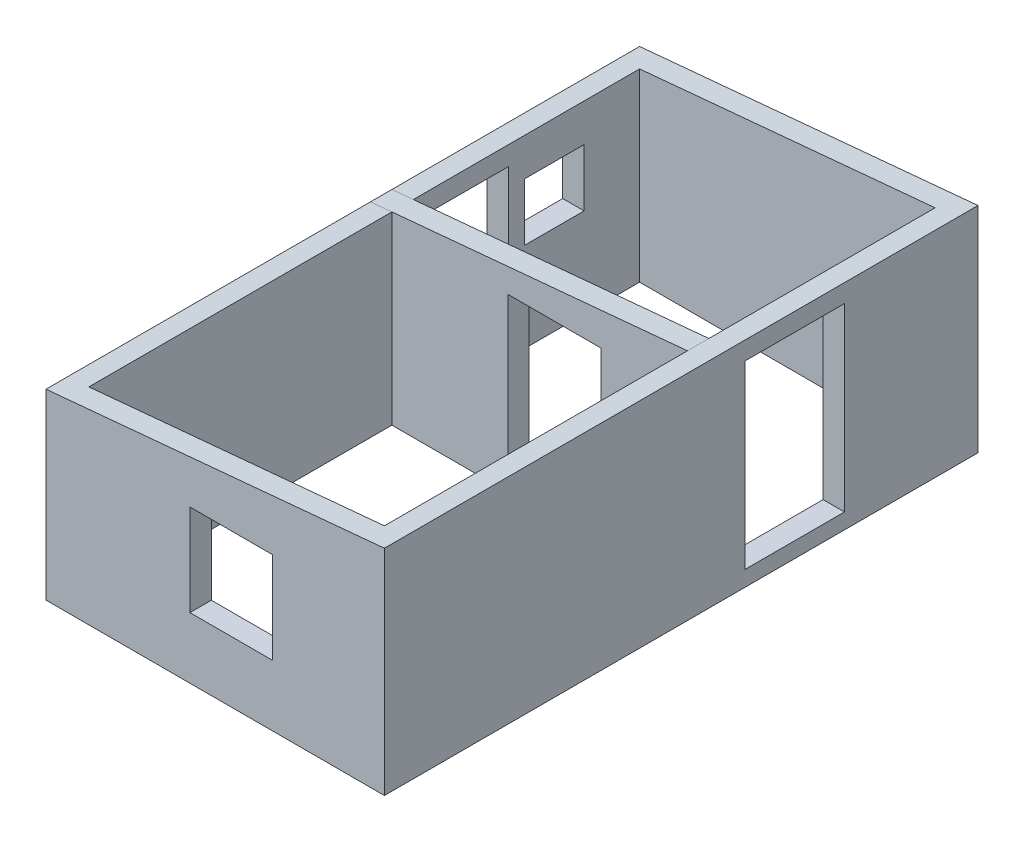
ISO-10303-21;
HEADER;
FILE_DESCRIPTION(('STEP AP214'),'2;1');
FILE_NAME('part.step','',(''),(''),'','','');
FILE_SCHEMA(('AUTOMOTIVE_DESIGN { 1 0 10303 214 1 1 1 1 }'));
ENDSEC;
DATA;
#1=APPLICATION_CONTEXT('core data for automotive mechanical design processes');
#2=APPLICATION_PROTOCOL_DEFINITION('international standard','automotive_design',2000,#1);
#3=PRODUCT_CONTEXT('',#1,'mechanical');
#4=PRODUCT('Part','Part','',(#3));
#5=PRODUCT_RELATED_PRODUCT_CATEGORY('part','',(#4));
#6=PRODUCT_DEFINITION_FORMATION('','',#4);
#7=PRODUCT_DEFINITION_CONTEXT('part definition',#1,'design');
#8=PRODUCT_DEFINITION('design','',#6,#7);
#9=PRODUCT_DEFINITION_SHAPE('','',#8);
#10=(LENGTH_UNIT() NAMED_UNIT(*) SI_UNIT(.MILLI.,.METRE.));
#11=(NAMED_UNIT(*) PLANE_ANGLE_UNIT() SI_UNIT($,.RADIAN.));
#12=(NAMED_UNIT(*) SI_UNIT($,.STERADIAN.) SOLID_ANGLE_UNIT());
#13=UNCERTAINTY_MEASURE_WITH_UNIT(LENGTH_MEASURE(1.E-05),#10,'distance_accuracy_value','');
#14=(GEOMETRIC_REPRESENTATION_CONTEXT(3) GLOBAL_UNCERTAINTY_ASSIGNED_CONTEXT((#13)) GLOBAL_UNIT_ASSIGNED_CONTEXT((#10,
#11,#12)) REPRESENTATION_CONTEXT('',''));
#15=CARTESIAN_POINT('',(0.,0.,0.));
#16=DIRECTION('',(0.,0.,1.));
#17=DIRECTION('',(1.,0.,0.));
#18=AXIS2_PLACEMENT_3D('',#15,#16,#17);
#19=CARTESIAN_POINT('',(0.,0.,0.));
#20=DIRECTION('',(0.,1.,0.));
#21=DIRECTION('',(0.,0.,1.));
#22=AXIS2_PLACEMENT_3D('',#19,#20,#21);
#23=PLANE('',#22);
#24=DIRECTION('',(0.,0.,1.));
#25=VECTOR('',#24,1.);
#26=CARTESIAN_POINT('',(0.,0.,-5543.));
#27=LINE('',#26,#25);
#28=CARTESIAN_POINT('',(0.,0.,-3313.22293132406));
#29=VERTEX_POINT('',#28);
#30=CARTESIAN_POINT('',(0.,0.,0.));
#31=VERTEX_POINT('',#30);
#32=EDGE_CURVE('E390',#29,#31,#27,.T.);
#33=ORIENTED_EDGE('',*,*,#32,.F.);
#34=DIRECTION('',(-1.,0.,0.));
#35=VECTOR('',#34,1.);
#36=CARTESIAN_POINT('',(1944.3628833001,0.,-3313.22293132406));
#37=LINE('',#36,#35);
#38=CARTESIAN_POINT('',(200.,0.,-3313.22293132406));
#39=VERTEX_POINT('',#38);
#40=EDGE_CURVE('E301',#39,#29,#37,.T.);
#41=ORIENTED_EDGE('',*,*,#40,.F.);
#42=DIRECTION('',(0.,0.,1.));
#43=VECTOR('',#42,1.);
#44=CARTESIAN_POINT('',(200.,0.,-5543.));
#45=LINE('',#44,#43);
#46=CARTESIAN_POINT('',(200.,0.,-200.));
#47=VERTEX_POINT('',#46);
#48=EDGE_CURVE('E368',#39,#47,#45,.T.);
#49=ORIENTED_EDGE('',*,*,#48,.T.);
#50=DIRECTION('',(1.,0.,0.));
#51=VECTOR('',#50,1.);
#52=CARTESIAN_POINT('',(0.,0.,-200.));
#53=LINE('',#52,#51);
#54=CARTESIAN_POINT('',(2960.,0.,-200.));
#55=VERTEX_POINT('',#54);
#56=EDGE_CURVE('E372',#47,#55,#53,.T.);
#57=ORIENTED_EDGE('',*,*,#56,.T.);
#58=DIRECTION('',(0.,0.,-1.));
#59=VECTOR('',#58,1.);
#60=CARTESIAN_POINT('',(2960.,0.,-5543.));
#61=LINE('',#60,#59);
#62=CARTESIAN_POINT('',(2960.,0.,-5343.));
#63=VERTEX_POINT('',#62);
#64=EDGE_CURVE('E375',#55,#63,#61,.T.);
#65=ORIENTED_EDGE('',*,*,#64,.T.);
#66=DIRECTION('',(-1.,0.,0.));
#67=VECTOR('',#66,1.);
#68=CARTESIAN_POINT('',(0.,0.,-5343.));
#69=LINE('',#68,#67);
#70=CARTESIAN_POINT('',(200.,0.,-5343.));
#71=VERTEX_POINT('',#70);
#72=EDGE_CURVE('E378',#63,#71,#69,.T.);
#73=ORIENTED_EDGE('',*,*,#72,.T.);
#74=CARTESIAN_POINT('',(200.,0.,-4118.48675987534));
#75=VERTEX_POINT('',#74);
#76=EDGE_CURVE('E369',#71,#75,#45,.T.);
#77=ORIENTED_EDGE('',*,*,#76,.T.);
#78=DIRECTION('',(-1.,0.,0.));
#79=VECTOR('',#78,1.);
#80=CARTESIAN_POINT('',(1944.3628833001,0.,-4118.48675987534));
#81=LINE('',#80,#79);
#82=CARTESIAN_POINT('',(0.,0.,-4118.48675987534));
#83=VERTEX_POINT('',#82);
#84=EDGE_CURVE('E309',#75,#83,#81,.T.);
#85=ORIENTED_EDGE('',*,*,#84,.T.);
#86=CARTESIAN_POINT('',(0.,0.,-5543.));
#87=VERTEX_POINT('',#86);
#88=EDGE_CURVE('E395',#87,#83,#27,.T.);
#89=ORIENTED_EDGE('',*,*,#88,.F.);
#90=DIRECTION('',(-1.,0.,0.));
#91=VECTOR('',#90,1.);
#92=CARTESIAN_POINT('',(0.,0.,-5543.));
#93=LINE('',#92,#91);
#94=CARTESIAN_POINT('',(3160.,0.,-5543.));
#95=VERTEX_POINT('',#94);
#96=EDGE_CURVE('E394',#95,#87,#93,.T.);
#97=ORIENTED_EDGE('',*,*,#96,.F.);
#98=DIRECTION('',(0.,0.,-1.));
#99=VECTOR('',#98,1.);
#100=CARTESIAN_POINT('',(3160.,0.,-5543.));
#101=LINE('',#100,#99);
#102=CARTESIAN_POINT('',(3160.,0.,0.));
#103=VERTEX_POINT('',#102);
#104=EDGE_CURVE('E400',#103,#95,#101,.T.);
#105=ORIENTED_EDGE('',*,*,#104,.F.);
#106=DIRECTION('',(1.,0.,0.));
#107=VECTOR('',#106,1.);
#108=CARTESIAN_POINT('',(0.,0.,0.));
#109=LINE('',#108,#107);
#110=EDGE_CURVE('E398',#31,#103,#109,.T.);
#111=ORIENTED_EDGE('',*,*,#110,.F.);
#112=EDGE_LOOP('',(#33,#41,#49,#57,#65,#73,#77,#85,#89,#97,#105,#111));
#113=FACE_BOUND('',#112,.T.);
#114=ADVANCED_FACE('F68',(#113),#23,.F.);
#115=CARTESIAN_POINT('',(0.,2000.,-5543.));
#116=DIRECTION('',(1.,0.,0.));
#117=DIRECTION('',(0.,0.,-1.));
#118=AXIS2_PLACEMENT_3D('',#115,#116,#117);
#119=PLANE('',#118);
#120=DIRECTION('',(0.,1.,0.));
#121=VECTOR('',#120,1.);
#122=CARTESIAN_POINT('',(0.,1372.0738646199,-4266.39236103783));
#123=LINE('',#122,#121);
#124=CARTESIAN_POINT('',(0.,835.231312252377,-4266.39236103783));
#125=VERTEX_POINT('',#124);
#126=CARTESIAN_POINT('',(0.,1372.0738646199,-4266.39236103783));
#127=VERTEX_POINT('',#126);
#128=EDGE_CURVE('E327',#125,#127,#123,.T.);
#129=ORIENTED_EDGE('',*,*,#128,.F.);
#130=DIRECTION('',(0.,0.,1.));
#131=VECTOR('',#130,1.);
#132=CARTESIAN_POINT('',(0.,835.231312252377,-4825.14685431831));
#133=LINE('',#132,#131);
#134=CARTESIAN_POINT('',(0.,835.231312252377,-4825.14685431831));
#135=VERTEX_POINT('',#134);
#136=EDGE_CURVE('E330',#135,#125,#133,.T.);
#137=ORIENTED_EDGE('',*,*,#136,.F.);
#138=DIRECTION('',(0.,-1.,0.));
#139=VECTOR('',#138,1.);
#140=CARTESIAN_POINT('',(0.,1372.0738646199,-4825.14685431831));
#141=LINE('',#140,#139);
#142=CARTESIAN_POINT('',(0.,1372.0738646199,-4825.14685431831));
#143=VERTEX_POINT('',#142);
#144=EDGE_CURVE('E323',#143,#135,#141,.T.);
#145=ORIENTED_EDGE('',*,*,#144,.F.);
#146=DIRECTION('',(0.,0.,-1.));
#147=VECTOR('',#146,1.);
#148=CARTESIAN_POINT('',(0.,1372.0738646199,-4825.14685431831));
#149=LINE('',#148,#147);
#150=EDGE_CURVE('E324',#127,#143,#149,.T.);
#151=ORIENTED_EDGE('',*,*,#150,.F.);
#152=EDGE_LOOP('',(#129,#137,#145,#151));
#153=FACE_BOUND('',#152,.T.);
#154=DIRECTION('',(0.,0.,-1.));
#155=VECTOR('',#154,1.);
#156=CARTESIAN_POINT('',(0.,1547.36939192358,-4118.48675987534));
#157=LINE('',#156,#155);
#158=CARTESIAN_POINT('',(0.,1547.36939192358,-3313.22293132406));
#159=VERTEX_POINT('',#158);
#160=CARTESIAN_POINT('',(0.,1547.36939192358,-4118.48675987534));
#161=VERTEX_POINT('',#160);
#162=EDGE_CURVE('E298',#159,#161,#157,.T.);
#163=ORIENTED_EDGE('',*,*,#162,.F.);
#164=DIRECTION('',(0.,1.,0.));
#165=VECTOR('',#164,1.);
#166=CARTESIAN_POINT('',(0.,1547.36939192358,-3313.22293132406));
#167=LINE('',#166,#165);
#168=EDGE_CURVE('E302',#29,#159,#167,.T.);
#169=ORIENTED_EDGE('',*,*,#168,.F.);
#170=ORIENTED_EDGE('',*,*,#32,.T.);
#171=DIRECTION('',(0.,-1.,0.));
#172=VECTOR('',#171,1.);
#173=CARTESIAN_POINT('',(0.,2000.,0.));
#174=LINE('',#173,#172);
#175=CARTESIAN_POINT('',(0.,1706.1006338305,0.));
#176=VERTEX_POINT('',#175);
#177=EDGE_CURVE('E76',#176,#31,#174,.T.);
#178=ORIENTED_EDGE('',*,*,#177,.F.);
#179=DIRECTION('',(0.,0.,1.));
#180=VECTOR('',#179,1.);
#181=CARTESIAN_POINT('',(0.,1706.1006338305,-5543.));
#182=LINE('',#181,#180);
#183=CARTESIAN_POINT('',(0.,1706.1006338305,-5543.));
#184=VERTEX_POINT('',#183);
#185=EDGE_CURVE('E359',#184,#176,#182,.T.);
#186=ORIENTED_EDGE('',*,*,#185,.F.);
#187=DIRECTION('',(0.,-1.,0.));
#188=VECTOR('',#187,1.);
#189=CARTESIAN_POINT('',(0.,2000.,-5543.));
#190=LINE('',#189,#188);
#191=EDGE_CURVE('E393',#184,#87,#190,.T.);
#192=ORIENTED_EDGE('',*,*,#191,.T.);
#193=ORIENTED_EDGE('',*,*,#88,.T.);
#194=DIRECTION('',(0.,-1.,0.));
#195=VECTOR('',#194,1.);
#196=CARTESIAN_POINT('',(0.,1547.36939192358,-4118.48675987534));
#197=LINE('',#196,#195);
#198=EDGE_CURVE('E297',#161,#83,#197,.T.);
#199=ORIENTED_EDGE('',*,*,#198,.F.);
#200=EDGE_LOOP('',(#163,#169,#170,#178,#186,#192,#193,#199));
#201=FACE_BOUND('',#200,.T.);
#202=ADVANCED_FACE('F70',(#153,#201),#119,.F.);
#203=CARTESIAN_POINT('',(0.,2000.,0.));
#204=DIRECTION('',(0.,0.,-1.));
#205=DIRECTION('',(-1.,0.,0.));
#206=AXIS2_PLACEMENT_3D('',#203,#204,#205);
#207=PLANE('',#206);
#208=DIRECTION('',(0.,1.,0.));
#209=VECTOR('',#208,1.);
#210=CARTESIAN_POINT('',(2115.85307941798,1425.39996617823,0.));
#211=LINE('',#210,#209);
#212=CARTESIAN_POINT('',(2115.85307941798,571.154702993131,0.));
#213=VERTEX_POINT('',#212);
#214=CARTESIAN_POINT('',(2115.85307941798,1425.39996617823,0.));
#215=VERTEX_POINT('',#214);
#216=EDGE_CURVE('E269',#213,#215,#211,.T.);
#217=ORIENTED_EDGE('',*,*,#216,.F.);
#218=DIRECTION('',(1.,0.,0.));
#219=VECTOR('',#218,1.);
#220=CARTESIAN_POINT('',(1343.61536149866,571.154702993131,0.));
#221=LINE('',#220,#219);
#222=CARTESIAN_POINT('',(1343.61536149866,571.154702993131,0.));
#223=VERTEX_POINT('',#222);
#224=EDGE_CURVE('E272',#223,#213,#221,.T.);
#225=ORIENTED_EDGE('',*,*,#224,.F.);
#226=DIRECTION('',(0.,-1.,0.));
#227=VECTOR('',#226,1.);
#228=CARTESIAN_POINT('',(1343.61536149866,1425.39996617823,0.));
#229=LINE('',#228,#227);
#230=CARTESIAN_POINT('',(1343.61536149866,1425.39996617823,0.));
#231=VERTEX_POINT('',#230);
#232=EDGE_CURVE('E265',#231,#223,#229,.T.);
#233=ORIENTED_EDGE('',*,*,#232,.F.);
#234=DIRECTION('',(-1.,0.,0.));
#235=VECTOR('',#234,1.);
#236=CARTESIAN_POINT('',(1343.61536149866,1425.39996617823,0.));
#237=LINE('',#236,#235);
#238=EDGE_CURVE('E266',#215,#231,#237,.T.);
#239=ORIENTED_EDGE('',*,*,#238,.F.);
#240=EDGE_LOOP('',(#217,#225,#233,#239));
#241=FACE_BOUND('',#240,.T.);
#242=DIRECTION('',(0.,-1.,0.));
#243=VECTOR('',#242,1.);
#244=CARTESIAN_POINT('',(3160.,2000.,0.));
#245=LINE('',#244,#243);
#246=CARTESIAN_POINT('',(3160.,2000.,0.));
#247=VERTEX_POINT('',#246);
#248=EDGE_CURVE('E408',#247,#103,#245,.T.);
#249=ORIENTED_EDGE('',*,*,#248,.F.);
#250=DIRECTION('',(0.9957027886276,0.0926064615414114,0.));
#251=VECTOR('',#250,1.);
#252=CARTESIAN_POINT('',(3160.,2000.,0.));
#253=LINE('',#252,#251);
#254=EDGE_CURVE('E355',#176,#247,#253,.T.);
#255=ORIENTED_EDGE('',*,*,#254,.F.);
#256=ORIENTED_EDGE('',*,*,#177,.T.);
#257=ORIENTED_EDGE('',*,*,#110,.T.);
#258=EDGE_LOOP('',(#249,#255,#256,#257));
#259=FACE_BOUND('',#258,.T.);
#260=ADVANCED_FACE('F416',(#241,#259),#207,.F.);
#261=CARTESIAN_POINT('',(3160.,2000.,-5543.));
#262=DIRECTION('',(-1.,0.,0.));
#263=DIRECTION('',(0.,0.,1.));
#264=AXIS2_PLACEMENT_3D('',#261,#262,#263);
#265=PLANE('',#264);
#266=DIRECTION('',(0.,1.,0.));
#267=VECTOR('',#266,1.);
#268=CARTESIAN_POINT('',(3160.,1830.68470668906,-4296.45198354059));
#269=LINE('',#268,#267);
#270=CARTESIAN_POINT('',(3160.,144.955037982847,-4296.45198354059));
#271=VERTEX_POINT('',#270);
#272=CARTESIAN_POINT('',(3160.,1830.68470668906,-4296.45198354059));
#273=VERTEX_POINT('',#272);
#274=EDGE_CURVE('E252',#271,#273,#269,.T.);
#275=ORIENTED_EDGE('',*,*,#274,.F.);
#276=DIRECTION('',(0.,0.,-1.));
#277=VECTOR('',#276,1.);
#278=CARTESIAN_POINT('',(3160.,144.955037982847,-3365.89023000623));
#279=LINE('',#278,#277);
#280=CARTESIAN_POINT('',(3160.,144.955037982847,-3365.89023000623));
#281=VERTEX_POINT('',#280);
#282=EDGE_CURVE('E245',#281,#271,#279,.T.);
#283=ORIENTED_EDGE('',*,*,#282,.F.);
#284=DIRECTION('',(0.,-1.,0.));
#285=VECTOR('',#284,1.);
#286=CARTESIAN_POINT('',(3160.,1830.68470668906,-3365.89023000623));
#287=LINE('',#286,#285);
#288=CARTESIAN_POINT('',(3160.,1830.68470668906,-3365.89023000623));
#289=VERTEX_POINT('',#288);
#290=EDGE_CURVE('E256',#289,#281,#287,.T.);
#291=ORIENTED_EDGE('',*,*,#290,.F.);
#292=DIRECTION('',(0.,0.,1.));
#293=VECTOR('',#292,1.);
#294=CARTESIAN_POINT('',(3160.,1830.68470668906,-3365.89023000623));
#295=LINE('',#294,#293);
#296=EDGE_CURVE('E83',#273,#289,#295,.T.);
#297=ORIENTED_EDGE('',*,*,#296,.F.);
#298=EDGE_LOOP('',(#275,#283,#291,#297));
#299=FACE_BOUND('',#298,.T.);
#300=ORIENTED_EDGE('',*,*,#104,.T.);
#301=DIRECTION('',(0.,-1.,0.));
#302=VECTOR('',#301,1.);
#303=CARTESIAN_POINT('',(3160.,2000.,-5543.));
#304=LINE('',#303,#302);
#305=CARTESIAN_POINT('',(3160.,2000.,-5543.));
#306=VERTEX_POINT('',#305);
#307=EDGE_CURVE('E405',#306,#95,#304,.T.);
#308=ORIENTED_EDGE('',*,*,#307,.F.);
#309=DIRECTION('',(0.,0.,-1.));
#310=VECTOR('',#309,1.);
#311=CARTESIAN_POINT('',(3160.,2000.,-5543.));
#312=LINE('',#311,#310);
#313=EDGE_CURVE('E391',#247,#306,#312,.T.);
#314=ORIENTED_EDGE('',*,*,#313,.F.);
#315=ORIENTED_EDGE('',*,*,#248,.T.);
#316=EDGE_LOOP('',(#300,#308,#314,#315));
#317=FACE_BOUND('',#316,.T.);
#318=ADVANCED_FACE('F427',(#299,#317),#265,.F.);
#319=CARTESIAN_POINT('',(0.,2000.,-5543.));
#320=DIRECTION('',(0.,0.,1.));
#321=DIRECTION('',(1.,0.,0.));
#322=AXIS2_PLACEMENT_3D('',#319,#320,#321);
#323=PLANE('',#322);
#324=ORIENTED_EDGE('',*,*,#191,.F.);
#325=DIRECTION('',(0.9957027886276,0.0926064615414114,0.));
#326=VECTOR('',#325,1.);
#327=CARTESIAN_POINT('',(3160.,2000.,-5543.));
#328=LINE('',#327,#326);
#329=EDGE_CURVE('E356',#184,#306,#328,.T.);
#330=ORIENTED_EDGE('',*,*,#329,.T.);
#331=ORIENTED_EDGE('',*,*,#307,.T.);
#332=ORIENTED_EDGE('',*,*,#96,.T.);
#333=EDGE_LOOP('',(#324,#330,#331,#332));
#334=FACE_BOUND('',#333,.T.);
#335=ADVANCED_FACE('F431',(#334),#323,.F.);
#336=CARTESIAN_POINT('',(200.,2000.,-5543.));
#337=DIRECTION('',(1.,0.,0.));
#338=DIRECTION('',(0.,0.,-1.));
#339=AXIS2_PLACEMENT_3D('',#336,#337,#338);
#340=PLANE('',#339);
#341=DIRECTION('',(0.,1.,0.));
#342=VECTOR('',#341,1.);
#343=CARTESIAN_POINT('',(200.,1547.36939192358,-3313.22293132406));
#344=LINE('',#343,#342);
#345=CARTESIAN_POINT('',(200.,1547.36939192358,-3313.22293132406));
#346=VERTEX_POINT('',#345);
#347=EDGE_CURVE('E315',#39,#346,#344,.T.);
#348=ORIENTED_EDGE('',*,*,#347,.T.);
#349=DIRECTION('',(0.,0.,-1.));
#350=VECTOR('',#349,1.);
#351=CARTESIAN_POINT('',(200.,1547.36939192358,-4118.48675987534));
#352=LINE('',#351,#350);
#353=CARTESIAN_POINT('',(200.,1547.36939192358,-4118.48675987534));
#354=VERTEX_POINT('',#353);
#355=EDGE_CURVE('E311',#346,#354,#352,.T.);
#356=ORIENTED_EDGE('',*,*,#355,.T.);
#357=DIRECTION('',(0.,-1.,0.));
#358=VECTOR('',#357,1.);
#359=CARTESIAN_POINT('',(200.,1547.36939192358,-4118.48675987534));
#360=LINE('',#359,#358);
#361=EDGE_CURVE('E306',#354,#75,#360,.T.);
#362=ORIENTED_EDGE('',*,*,#361,.T.);
#363=ORIENTED_EDGE('',*,*,#76,.F.);
#364=DIRECTION('',(0.,-1.,0.));
#365=VECTOR('',#364,1.);
#366=CARTESIAN_POINT('',(200.,2000.,-5343.));
#367=LINE('',#366,#365);
#368=CARTESIAN_POINT('',(200.,1724.70185953743,-5343.));
#369=VERTEX_POINT('',#368);
#370=EDGE_CURVE('E381',#369,#71,#367,.T.);
#371=ORIENTED_EDGE('',*,*,#370,.F.);
#372=DIRECTION('',(0.,0.,-1.));
#373=VECTOR('',#372,1.);
#374=CARTESIAN_POINT('',(200.,1724.70185953743,-5543.));
#375=LINE('',#374,#373);
#376=CARTESIAN_POINT('',(200.,1724.70185953743,-200.));
#377=VERTEX_POINT('',#376);
#378=EDGE_CURVE('E366',#377,#369,#375,.T.);
#379=ORIENTED_EDGE('',*,*,#378,.F.);
#380=DIRECTION('',(0.,-1.,0.));
#381=VECTOR('',#380,1.);
#382=CARTESIAN_POINT('',(200.,2000.,-200.));
#383=LINE('',#382,#381);
#384=EDGE_CURVE('E387',#377,#47,#383,.T.);
#385=ORIENTED_EDGE('',*,*,#384,.T.);
#386=ORIENTED_EDGE('',*,*,#48,.F.);
#387=EDGE_LOOP('',(#348,#356,#362,#363,#371,#379,#385,#386));
#388=FACE_BOUND('',#387,.T.);
#389=DIRECTION('',(0.,0.,1.));
#390=VECTOR('',#389,1.);
#391=CARTESIAN_POINT('',(200.,835.231312252377,-4825.14685431831));
#392=LINE('',#391,#390);
#393=CARTESIAN_POINT('',(200.,835.231312252377,-4825.14685431831));
#394=VERTEX_POINT('',#393);
#395=CARTESIAN_POINT('',(200.,835.231312252377,-4266.39236103783));
#396=VERTEX_POINT('',#395);
#397=EDGE_CURVE('E326',#394,#396,#392,.T.);
#398=ORIENTED_EDGE('',*,*,#397,.T.);
#399=DIRECTION('',(0.,1.,0.));
#400=VECTOR('',#399,1.);
#401=CARTESIAN_POINT('',(200.,1372.0738646199,-4266.39236103783));
#402=LINE('',#401,#400);
#403=CARTESIAN_POINT('',(200.,1372.0738646199,-4266.39236103783));
#404=VERTEX_POINT('',#403);
#405=EDGE_CURVE('E347',#396,#404,#402,.T.);
#406=ORIENTED_EDGE('',*,*,#405,.T.);
#407=DIRECTION('',(0.,0.,-1.));
#408=VECTOR('',#407,1.);
#409=CARTESIAN_POINT('',(200.,1372.0738646199,-4825.14685431831));
#410=LINE('',#409,#408);
#411=CARTESIAN_POINT('',(200.,1372.0738646199,-4825.14685431831));
#412=VERTEX_POINT('',#411);
#413=EDGE_CURVE('E343',#404,#412,#410,.T.);
#414=ORIENTED_EDGE('',*,*,#413,.T.);
#415=DIRECTION('',(0.,-1.,0.));
#416=VECTOR('',#415,1.);
#417=CARTESIAN_POINT('',(200.,1372.0738646199,-4825.14685431831));
#418=LINE('',#417,#416);
#419=EDGE_CURVE('E338',#412,#394,#418,.T.);
#420=ORIENTED_EDGE('',*,*,#419,.T.);
#421=EDGE_LOOP('',(#398,#406,#414,#420));
#422=FACE_BOUND('',#421,.T.);
#423=ADVANCED_FACE('F441',(#388,#422),#340,.T.);
#424=CARTESIAN_POINT('',(0.,2000.,-200.));
#425=DIRECTION('',(0.,0.,-1.));
#426=DIRECTION('',(-1.,0.,0.));
#427=AXIS2_PLACEMENT_3D('',#424,#425,#426);
#428=PLANE('',#427);
#429=DIRECTION('',(1.,0.,0.));
#430=VECTOR('',#429,1.);
#431=CARTESIAN_POINT('',(1343.61536149866,571.154702993131,-200.));
#432=LINE('',#431,#430);
#433=CARTESIAN_POINT('',(1343.61536149866,571.154702993131,-200.));
#434=VERTEX_POINT('',#433);
#435=CARTESIAN_POINT('',(2115.85307941798,571.154702993131,-200.));
#436=VERTEX_POINT('',#435);
#437=EDGE_CURVE('E268',#434,#436,#432,.T.);
#438=ORIENTED_EDGE('',*,*,#437,.T.);
#439=DIRECTION('',(0.,1.,0.));
#440=VECTOR('',#439,1.);
#441=CARTESIAN_POINT('',(2115.85307941798,1425.39996617823,-200.));
#442=LINE('',#441,#440);
#443=CARTESIAN_POINT('',(2115.85307941798,1425.39996617823,-200.));
#444=VERTEX_POINT('',#443);
#445=EDGE_CURVE('E289',#436,#444,#442,.T.);
#446=ORIENTED_EDGE('',*,*,#445,.T.);
#447=DIRECTION('',(-1.,0.,0.));
#448=VECTOR('',#447,1.);
#449=CARTESIAN_POINT('',(1343.61536149866,1425.39996617823,-200.));
#450=LINE('',#449,#448);
#451=CARTESIAN_POINT('',(1343.61536149866,1425.39996617823,-200.));
#452=VERTEX_POINT('',#451);
#453=EDGE_CURVE('E285',#444,#452,#450,.T.);
#454=ORIENTED_EDGE('',*,*,#453,.T.);
#455=DIRECTION('',(0.,-1.,0.));
#456=VECTOR('',#455,1.);
#457=CARTESIAN_POINT('',(1343.61536149866,1425.39996617823,-200.));
#458=LINE('',#457,#456);
#459=EDGE_CURVE('E280',#452,#434,#458,.T.);
#460=ORIENTED_EDGE('',*,*,#459,.T.);
#461=EDGE_LOOP('',(#438,#446,#454,#460));
#462=FACE_BOUND('',#461,.T.);
#463=DIRECTION('',(-0.9957027886276,-0.0926064615414114,0.));
#464=VECTOR('',#463,1.);
#465=CARTESIAN_POINT('',(27.1000232327381,1708.62110207457,-200.));
#466=LINE('',#465,#464);
#467=CARTESIAN_POINT('',(2960.,1981.39877429307,-200.));
#468=VERTEX_POINT('',#467);
#469=EDGE_CURVE('E364',#468,#377,#466,.T.);
#470=ORIENTED_EDGE('',*,*,#469,.F.);
#471=DIRECTION('',(0.,-1.,0.));
#472=VECTOR('',#471,1.);
#473=CARTESIAN_POINT('',(2960.,2000.,-200.));
#474=LINE('',#473,#472);
#475=EDGE_CURVE('E385',#468,#55,#474,.T.);
#476=ORIENTED_EDGE('',*,*,#475,.T.);
#477=ORIENTED_EDGE('',*,*,#56,.F.);
#478=ORIENTED_EDGE('',*,*,#384,.F.);
#479=EDGE_LOOP('',(#470,#476,#477,#478));
#480=FACE_BOUND('',#479,.T.);
#481=ADVANCED_FACE('F456',(#462,#480),#428,.T.);
#482=CARTESIAN_POINT('',(2960.,2000.,-5543.));
#483=DIRECTION('',(-1.,0.,0.));
#484=DIRECTION('',(0.,0.,1.));
#485=AXIS2_PLACEMENT_3D('',#482,#483,#484);
#486=PLANE('',#485);
#487=DIRECTION('',(0.,0.,-1.));
#488=VECTOR('',#487,1.);
#489=CARTESIAN_POINT('',(2960.,144.955037982847,-3365.89023000623));
#490=LINE('',#489,#488);
#491=CARTESIAN_POINT('',(2960.,144.955037982847,-3365.89023000623));
#492=VERTEX_POINT('',#491);
#493=CARTESIAN_POINT('',(2960.,144.955037982847,-4296.45198354059));
#494=VERTEX_POINT('',#493);
#495=EDGE_CURVE('E242',#492,#494,#490,.T.);
#496=ORIENTED_EDGE('',*,*,#495,.T.);
#497=DIRECTION('',(0.,1.,0.));
#498=VECTOR('',#497,1.);
#499=CARTESIAN_POINT('',(2960.,1830.68470668906,-4296.45198354059));
#500=LINE('',#499,#498);
#501=CARTESIAN_POINT('',(2960.,1830.68470668906,-4296.45198354059));
#502=VERTEX_POINT('',#501);
#503=EDGE_CURVE('E229',#494,#502,#500,.T.);
#504=ORIENTED_EDGE('',*,*,#503,.T.);
#505=DIRECTION('',(0.,0.,1.));
#506=VECTOR('',#505,1.);
#507=CARTESIAN_POINT('',(2960.,1830.68470668906,-3365.89023000623));
#508=LINE('',#507,#506);
#509=CARTESIAN_POINT('',(2960.,1830.68470668906,-3365.89023000623));
#510=VERTEX_POINT('',#509);
#511=EDGE_CURVE('E260',#502,#510,#508,.T.);
#512=ORIENTED_EDGE('',*,*,#511,.T.);
#513=DIRECTION('',(0.,-1.,0.));
#514=VECTOR('',#513,1.);
#515=CARTESIAN_POINT('',(2960.,1830.68470668906,-3365.89023000623));
#516=LINE('',#515,#514);
#517=EDGE_CURVE('E250',#510,#492,#516,.T.);
#518=ORIENTED_EDGE('',*,*,#517,.T.);
#519=EDGE_LOOP('',(#496,#504,#512,#518));
#520=FACE_BOUND('',#519,.T.);
#521=DIRECTION('',(0.,0.,1.));
#522=VECTOR('',#521,1.);
#523=CARTESIAN_POINT('',(2960.,1981.39877429307,-5543.));
#524=LINE('',#523,#522);
#525=CARTESIAN_POINT('',(2960.,1981.39877429307,-5343.));
#526=VERTEX_POINT('',#525);
#527=EDGE_CURVE('E362',#526,#468,#524,.T.);
#528=ORIENTED_EDGE('',*,*,#527,.F.);
#529=DIRECTION('',(0.,-1.,0.));
#530=VECTOR('',#529,1.);
#531=CARTESIAN_POINT('',(2960.,2000.,-5343.));
#532=LINE('',#531,#530);
#533=EDGE_CURVE('E383',#526,#63,#532,.T.);
#534=ORIENTED_EDGE('',*,*,#533,.T.);
#535=ORIENTED_EDGE('',*,*,#64,.F.);
#536=ORIENTED_EDGE('',*,*,#475,.F.);
#537=EDGE_LOOP('',(#528,#534,#535,#536));
#538=FACE_BOUND('',#537,.T.);
#539=ADVANCED_FACE('F248',(#520,#538),#486,.T.);
#540=CARTESIAN_POINT('',(0.,2000.,-5343.));
#541=DIRECTION('',(0.,0.,1.));
#542=DIRECTION('',(1.,0.,0.));
#543=AXIS2_PLACEMENT_3D('',#540,#541,#542);
#544=PLANE('',#543);
#545=DIRECTION('',(0.9957027886276,0.0926064615414114,0.));
#546=VECTOR('',#545,1.);
#547=CARTESIAN_POINT('',(27.1000232327381,1708.62110207457,-5343.));
#548=LINE('',#547,#546);
#549=EDGE_CURVE('E13',#369,#526,#548,.T.);
#550=ORIENTED_EDGE('',*,*,#549,.F.);
#551=ORIENTED_EDGE('',*,*,#370,.T.);
#552=ORIENTED_EDGE('',*,*,#72,.F.);
#553=ORIENTED_EDGE('',*,*,#533,.F.);
#554=EDGE_LOOP('',(#550,#551,#552,#553));
#555=FACE_BOUND('',#554,.T.);
#556=ADVANCED_FACE('F464',(#555),#544,.T.);
#557=CARTESIAN_POINT('',(3160.,2000.,-5543.));
#558=DIRECTION('',(0.0926064615414114,-0.9957027886276,0.));
#559=DIRECTION('',(0.9957027886276,0.0926064615414114,0.));
#560=AXIS2_PLACEMENT_3D('',#557,#558,#559);
#561=PLANE('',#560);
#562=ORIENTED_EDGE('',*,*,#378,.T.);
#563=ORIENTED_EDGE('',*,*,#549,.T.);
#564=ORIENTED_EDGE('',*,*,#527,.T.);
#565=ORIENTED_EDGE('',*,*,#469,.T.);
#566=EDGE_LOOP('',(#562,#563,#564,#565));
#567=FACE_BOUND('',#566,.T.);
#568=ORIENTED_EDGE('',*,*,#254,.T.);
#569=ORIENTED_EDGE('',*,*,#313,.T.);
#570=ORIENTED_EDGE('',*,*,#329,.F.);
#571=ORIENTED_EDGE('',*,*,#185,.T.);
#572=EDGE_LOOP('',(#568,#569,#570,#571));
#573=FACE_BOUND('',#572,.T.);
#574=ADVANCED_FACE('F433',(#567,#573),#561,.F.);
#575=CARTESIAN_POINT('',(1944.3628833001,835.231312252377,-4825.14685431831));
#576=DIRECTION('',(0.,-1.,0.));
#577=DIRECTION('',(0.,0.,-1.));
#578=AXIS2_PLACEMENT_3D('',#575,#576,#577);
#579=PLANE('',#578);
#580=DIRECTION('',(-1.,0.,0.));
#581=VECTOR('',#580,1.);
#582=CARTESIAN_POINT('',(1944.3628833001,835.231312252377,-4825.14685431831));
#583=LINE('',#582,#581);
#584=EDGE_CURVE('E341',#394,#135,#583,.T.);
#585=ORIENTED_EDGE('',*,*,#584,.T.);
#586=ORIENTED_EDGE('',*,*,#136,.T.);
#587=DIRECTION('',(-1.,0.,0.));
#588=VECTOR('',#587,1.);
#589=CARTESIAN_POINT('',(1944.3628833001,835.231312252377,-4266.39236103783));
#590=LINE('',#589,#588);
#591=EDGE_CURVE('E337',#396,#125,#590,.T.);
#592=ORIENTED_EDGE('',*,*,#591,.F.);
#593=ORIENTED_EDGE('',*,*,#397,.F.);
#594=EDGE_LOOP('',(#585,#586,#592,#593));
#595=FACE_BOUND('',#594,.T.);
#596=ADVANCED_FACE('F467',(#595),#579,.F.);
#597=CARTESIAN_POINT('',(1944.3628833001,1372.0738646199,-4266.39236103783));
#598=DIRECTION('',(0.,0.,1.));
#599=DIRECTION('',(1.,0.,0.));
#600=AXIS2_PLACEMENT_3D('',#597,#598,#599);
#601=PLANE('',#600);
#602=ORIENTED_EDGE('',*,*,#591,.T.);
#603=ORIENTED_EDGE('',*,*,#128,.T.);
#604=DIRECTION('',(-1.,0.,0.));
#605=VECTOR('',#604,1.);
#606=CARTESIAN_POINT('',(1944.3628833001,1372.0738646199,-4266.39236103783));
#607=LINE('',#606,#605);
#608=EDGE_CURVE('E346',#404,#127,#607,.T.);
#609=ORIENTED_EDGE('',*,*,#608,.F.);
#610=ORIENTED_EDGE('',*,*,#405,.F.);
#611=EDGE_LOOP('',(#602,#603,#609,#610));
#612=FACE_BOUND('',#611,.T.);
#613=ADVANCED_FACE('F473',(#612),#601,.F.);
#614=CARTESIAN_POINT('',(1944.3628833001,1372.0738646199,-4825.14685431831));
#615=DIRECTION('',(0.,1.,0.));
#616=DIRECTION('',(0.,0.,1.));
#617=AXIS2_PLACEMENT_3D('',#614,#615,#616);
#618=PLANE('',#617);
#619=ORIENTED_EDGE('',*,*,#608,.T.);
#620=ORIENTED_EDGE('',*,*,#150,.T.);
#621=DIRECTION('',(-1.,0.,0.));
#622=VECTOR('',#621,1.);
#623=CARTESIAN_POINT('',(1944.3628833001,1372.0738646199,-4825.14685431831));
#624=LINE('',#623,#622);
#625=EDGE_CURVE('E342',#412,#143,#624,.T.);
#626=ORIENTED_EDGE('',*,*,#625,.F.);
#627=ORIENTED_EDGE('',*,*,#413,.F.);
#628=EDGE_LOOP('',(#619,#620,#626,#627));
#629=FACE_BOUND('',#628,.T.);
#630=ADVANCED_FACE('F599',(#629),#618,.F.);
#631=CARTESIAN_POINT('',(1944.3628833001,1372.0738646199,-4825.14685431831));
#632=DIRECTION('',(0.,0.,-1.));
#633=DIRECTION('',(-1.,0.,0.));
#634=AXIS2_PLACEMENT_3D('',#631,#632,#633);
#635=PLANE('',#634);
#636=ORIENTED_EDGE('',*,*,#625,.T.);
#637=ORIENTED_EDGE('',*,*,#144,.T.);
#638=ORIENTED_EDGE('',*,*,#584,.F.);
#639=ORIENTED_EDGE('',*,*,#419,.F.);
#640=EDGE_LOOP('',(#636,#637,#638,#639));
#641=FACE_BOUND('',#640,.T.);
#642=ADVANCED_FACE('F596',(#641),#635,.F.);
#643=CARTESIAN_POINT('',(1944.3628833001,1547.36939192358,-3313.22293132406));
#644=DIRECTION('',(0.,0.,1.));
#645=DIRECTION('',(1.,0.,0.));
#646=AXIS2_PLACEMENT_3D('',#643,#644,#645);
#647=PLANE('',#646);
#648=ORIENTED_EDGE('',*,*,#40,.T.);
#649=ORIENTED_EDGE('',*,*,#168,.T.);
#650=DIRECTION('',(-1.,0.,0.));
#651=VECTOR('',#650,1.);
#652=CARTESIAN_POINT('',(1944.3628833001,1547.36939192358,-3313.22293132406));
#653=LINE('',#652,#651);
#654=EDGE_CURVE('E314',#346,#159,#653,.T.);
#655=ORIENTED_EDGE('',*,*,#654,.F.);
#656=ORIENTED_EDGE('',*,*,#347,.F.);
#657=EDGE_LOOP('',(#648,#649,#655,#656));
#658=FACE_BOUND('',#657,.T.);
#659=ADVANCED_FACE('F449',(#658),#647,.F.);
#660=CARTESIAN_POINT('',(1944.3628833001,1547.36939192358,-4118.48675987534));
#661=DIRECTION('',(0.,1.,0.));
#662=DIRECTION('',(0.,0.,1.));
#663=AXIS2_PLACEMENT_3D('',#660,#661,#662);
#664=PLANE('',#663);
#665=ORIENTED_EDGE('',*,*,#654,.T.);
#666=ORIENTED_EDGE('',*,*,#162,.T.);
#667=DIRECTION('',(-1.,0.,0.));
#668=VECTOR('',#667,1.);
#669=CARTESIAN_POINT('',(1944.3628833001,1547.36939192358,-4118.48675987534));
#670=LINE('',#669,#668);
#671=EDGE_CURVE('E310',#354,#161,#670,.T.);
#672=ORIENTED_EDGE('',*,*,#671,.F.);
#673=ORIENTED_EDGE('',*,*,#355,.F.);
#674=EDGE_LOOP('',(#665,#666,#672,#673));
#675=FACE_BOUND('',#674,.T.);
#676=ADVANCED_FACE('F447',(#675),#664,.F.);
#677=CARTESIAN_POINT('',(1944.3628833001,1547.36939192358,-4118.48675987534));
#678=DIRECTION('',(0.,0.,-1.));
#679=DIRECTION('',(-1.,0.,0.));
#680=AXIS2_PLACEMENT_3D('',#677,#678,#679);
#681=PLANE('',#680);
#682=ORIENTED_EDGE('',*,*,#671,.T.);
#683=ORIENTED_EDGE('',*,*,#198,.T.);
#684=ORIENTED_EDGE('',*,*,#84,.F.);
#685=ORIENTED_EDGE('',*,*,#361,.F.);
#686=EDGE_LOOP('',(#682,#683,#684,#685));
#687=FACE_BOUND('',#686,.T.);
#688=ADVANCED_FACE('F438',(#687),#681,.F.);
#689=CARTESIAN_POINT('',(1343.61536149866,571.154702993131,-1351.55810216047));
#690=DIRECTION('',(0.,-1.,0.));
#691=DIRECTION('',(0.,0.,-1.));
#692=AXIS2_PLACEMENT_3D('',#689,#690,#691);
#693=PLANE('',#692);
#694=DIRECTION('',(0.,0.,1.));
#695=VECTOR('',#694,1.);
#696=CARTESIAN_POINT('',(1343.61536149866,571.154702993131,-1351.55810216047));
#697=LINE('',#696,#695);
#698=EDGE_CURVE('E283',#434,#223,#697,.T.);
#699=ORIENTED_EDGE('',*,*,#698,.T.);
#700=ORIENTED_EDGE('',*,*,#224,.T.);
#701=DIRECTION('',(0.,0.,1.));
#702=VECTOR('',#701,1.);
#703=CARTESIAN_POINT('',(2115.85307941798,571.154702993131,-1351.55810216047));
#704=LINE('',#703,#702);
#705=EDGE_CURVE('E279',#436,#213,#704,.T.);
#706=ORIENTED_EDGE('',*,*,#705,.F.);
#707=ORIENTED_EDGE('',*,*,#437,.F.);
#708=EDGE_LOOP('',(#699,#700,#706,#707));
#709=FACE_BOUND('',#708,.T.);
#710=ADVANCED_FACE('F504',(#709),#693,.F.);
#711=CARTESIAN_POINT('',(2115.85307941798,1425.39996617823,-1351.55810216047));
#712=DIRECTION('',(1.,0.,0.));
#713=DIRECTION('',(0.,0.,-1.));
#714=AXIS2_PLACEMENT_3D('',#711,#712,#713);
#715=PLANE('',#714);
#716=ORIENTED_EDGE('',*,*,#705,.T.);
#717=ORIENTED_EDGE('',*,*,#216,.T.);
#718=DIRECTION('',(0.,0.,1.));
#719=VECTOR('',#718,1.);
#720=CARTESIAN_POINT('',(2115.85307941798,1425.39996617823,-1351.55810216047));
#721=LINE('',#720,#719);
#722=EDGE_CURVE('E288',#444,#215,#721,.T.);
#723=ORIENTED_EDGE('',*,*,#722,.F.);
#724=ORIENTED_EDGE('',*,*,#445,.F.);
#725=EDGE_LOOP('',(#716,#717,#723,#724));
#726=FACE_BOUND('',#725,.T.);
#727=ADVANCED_FACE('F500',(#726),#715,.F.);
#728=CARTESIAN_POINT('',(1343.61536149866,1425.39996617823,-1351.55810216047));
#729=DIRECTION('',(0.,1.,0.));
#730=DIRECTION('',(0.,0.,1.));
#731=AXIS2_PLACEMENT_3D('',#728,#729,#730);
#732=PLANE('',#731);
#733=ORIENTED_EDGE('',*,*,#722,.T.);
#734=ORIENTED_EDGE('',*,*,#238,.T.);
#735=DIRECTION('',(0.,0.,1.));
#736=VECTOR('',#735,1.);
#737=CARTESIAN_POINT('',(1343.61536149866,1425.39996617823,-1351.55810216047));
#738=LINE('',#737,#736);
#739=EDGE_CURVE('E284',#452,#231,#738,.T.);
#740=ORIENTED_EDGE('',*,*,#739,.F.);
#741=ORIENTED_EDGE('',*,*,#453,.F.);
#742=EDGE_LOOP('',(#733,#734,#740,#741));
#743=FACE_BOUND('',#742,.T.);
#744=ADVANCED_FACE('F509',(#743),#732,.F.);
#745=CARTESIAN_POINT('',(1343.61536149866,1425.39996617823,-1351.55810216047));
#746=DIRECTION('',(-1.,0.,0.));
#747=DIRECTION('',(0.,0.,1.));
#748=AXIS2_PLACEMENT_3D('',#745,#746,#747);
#749=PLANE('',#748);
#750=ORIENTED_EDGE('',*,*,#739,.T.);
#751=ORIENTED_EDGE('',*,*,#232,.T.);
#752=ORIENTED_EDGE('',*,*,#698,.F.);
#753=ORIENTED_EDGE('',*,*,#459,.F.);
#754=EDGE_LOOP('',(#750,#751,#752,#753));
#755=FACE_BOUND('',#754,.T.);
#756=ADVANCED_FACE('F506',(#755),#749,.F.);
#757=CARTESIAN_POINT('',(1034.47937089802,144.955037982847,-3365.89023000623));
#758=DIRECTION('',(0.,-1.,0.));
#759=DIRECTION('',(0.,0.,-1.));
#760=AXIS2_PLACEMENT_3D('',#757,#758,#759);
#761=PLANE('',#760);
#762=DIRECTION('',(1.,0.,0.));
#763=VECTOR('',#762,1.);
#764=CARTESIAN_POINT('',(1034.47937089802,144.955037982847,-3365.89023000623));
#765=LINE('',#764,#763);
#766=EDGE_CURVE('E91',#492,#281,#765,.T.);
#767=ORIENTED_EDGE('',*,*,#766,.T.);
#768=ORIENTED_EDGE('',*,*,#282,.T.);
#769=DIRECTION('',(1.,0.,0.));
#770=VECTOR('',#769,1.);
#771=CARTESIAN_POINT('',(1034.47937089802,144.955037982847,-4296.45198354059));
#772=LINE('',#771,#770);
#773=EDGE_CURVE('E233',#494,#271,#772,.T.);
#774=ORIENTED_EDGE('',*,*,#773,.F.);
#775=ORIENTED_EDGE('',*,*,#495,.F.);
#776=EDGE_LOOP('',(#767,#768,#774,#775));
#777=FACE_BOUND('',#776,.T.);
#778=ADVANCED_FACE('F241',(#777),#761,.F.);
#779=CARTESIAN_POINT('',(1034.47937089802,1830.68470668906,-4296.45198354059));
#780=DIRECTION('',(0.,0.,-1.));
#781=DIRECTION('',(-1.,0.,0.));
#782=AXIS2_PLACEMENT_3D('',#779,#780,#781);
#783=PLANE('',#782);
#784=ORIENTED_EDGE('',*,*,#773,.T.);
#785=ORIENTED_EDGE('',*,*,#274,.T.);
#786=DIRECTION('',(1.,0.,0.));
#787=VECTOR('',#786,1.);
#788=CARTESIAN_POINT('',(1034.47937089802,1830.68470668906,-4296.45198354059));
#789=LINE('',#788,#787);
#790=EDGE_CURVE('E235',#502,#273,#789,.T.);
#791=ORIENTED_EDGE('',*,*,#790,.F.);
#792=ORIENTED_EDGE('',*,*,#503,.F.);
#793=EDGE_LOOP('',(#784,#785,#791,#792));
#794=FACE_BOUND('',#793,.T.);
#795=ADVANCED_FACE('F231',(#794),#783,.F.);
#796=CARTESIAN_POINT('',(1034.47937089802,1830.68470668906,-3365.89023000623));
#797=DIRECTION('',(0.,1.,0.));
#798=DIRECTION('',(0.,0.,1.));
#799=AXIS2_PLACEMENT_3D('',#796,#797,#798);
#800=PLANE('',#799);
#801=ORIENTED_EDGE('',*,*,#790,.T.);
#802=ORIENTED_EDGE('',*,*,#296,.T.);
#803=DIRECTION('',(1.,0.,0.));
#804=VECTOR('',#803,1.);
#805=CARTESIAN_POINT('',(1034.47937089802,1830.68470668906,-3365.89023000623));
#806=LINE('',#805,#804);
#807=EDGE_CURVE('E259',#510,#289,#806,.T.);
#808=ORIENTED_EDGE('',*,*,#807,.F.);
#809=ORIENTED_EDGE('',*,*,#511,.F.);
#810=EDGE_LOOP('',(#801,#802,#808,#809));
#811=FACE_BOUND('',#810,.T.);
#812=ADVANCED_FACE('F561',(#811),#800,.F.);
#813=CARTESIAN_POINT('',(1034.47937089802,1830.68470668906,-3365.89023000623));
#814=DIRECTION('',(0.,0.,1.));
#815=DIRECTION('',(1.,0.,0.));
#816=AXIS2_PLACEMENT_3D('',#813,#814,#815);
#817=PLANE('',#816);
#818=ORIENTED_EDGE('',*,*,#807,.T.);
#819=ORIENTED_EDGE('',*,*,#290,.T.);
#820=ORIENTED_EDGE('',*,*,#766,.F.);
#821=ORIENTED_EDGE('',*,*,#517,.F.);
#822=EDGE_LOOP('',(#818,#819,#820,#821));
#823=FACE_BOUND('',#822,.T.);
#824=ADVANCED_FACE('F570',(#823),#817,.F.);
#825=CLOSED_SHELL('',(#114,#202,#260,#318,#335,#423,#481,#539,#556,#574,#596,#613,#630,#642,
#659,#676,#688,#710,#727,#744,#756,#778,#795,#812,#824));
#826=MANIFOLD_SOLID_BREP('B2',#825);
#827=CARTESIAN_POINT('',(3160.,0.,-3029.9974846167));
#828=DIRECTION('',(0.,-1.,0.));
#829=DIRECTION('',(-1.,0.,0.));
#830=AXIS2_PLACEMENT_3D('',#827,#828,#829);
#831=PLANE('',#830);
#832=DIRECTION('',(0.,0.,1.));
#833=VECTOR('',#832,1.);
#834=CARTESIAN_POINT('',(2153.35719690655,0.,-5051.48317480905));
#835=LINE('',#834,#833);
#836=CARTESIAN_POINT('',(2153.35719690655,0.,-3229.9974846167));
#837=VERTEX_POINT('',#836);
#838=CARTESIAN_POINT('',(2153.35719690655,0.,-3029.9974846167));
#839=VERTEX_POINT('',#838);
#840=EDGE_CURVE('E804',#837,#839,#835,.T.);
#841=ORIENTED_EDGE('',*,*,#840,.F.);
#842=DIRECTION('',(1.,0.,0.));
#843=VECTOR('',#842,1.);
#844=CARTESIAN_POINT('',(0.,0.,-3229.9974846167));
#845=LINE('',#844,#843);
#846=CARTESIAN_POINT('',(3160.,0.,-3229.9974846167));
#847=VERTEX_POINT('',#846);
#848=EDGE_CURVE('E771',#837,#847,#845,.T.);
#849=ORIENTED_EDGE('',*,*,#848,.T.);
#850=DIRECTION('',(0.,0.,1.));
#851=VECTOR('',#850,1.);
#852=CARTESIAN_POINT('',(3160.,0.,-3229.9974846167));
#853=LINE('',#852,#851);
#854=CARTESIAN_POINT('',(3160.,0.,-3029.9974846167));
#855=VERTEX_POINT('',#854);
#856=EDGE_CURVE('E792',#847,#855,#853,.T.);
#857=ORIENTED_EDGE('',*,*,#856,.T.);
#858=DIRECTION('',(1.,0.,0.));
#859=VECTOR('',#858,1.);
#860=CARTESIAN_POINT('',(0.,0.,-3029.9974846167));
#861=LINE('',#860,#859);
#862=EDGE_CURVE('E796',#839,#855,#861,.T.);
#863=ORIENTED_EDGE('',*,*,#862,.F.);
#864=EDGE_LOOP('',(#841,#849,#857,#863));
#865=FACE_BOUND('',#864,.T.);
#866=ADVANCED_FACE('F706',(#865),#831,.T.);
#867=CARTESIAN_POINT('',(0.,2000.,-3029.9974846167));
#868=DIRECTION('',(0.,0.,-1.));
#869=DIRECTION('',(-1.,0.,0.));
#870=AXIS2_PLACEMENT_3D('',#867,#868,#869);
#871=PLANE('',#870);
#872=DIRECTION('',(-1.,0.,0.));
#873=VECTOR('',#872,1.);
#874=CARTESIAN_POINT('',(1282.3926454304,1599.75962870909,-3029.9974846167));
#875=LINE('',#874,#873);
#876=CARTESIAN_POINT('',(2153.35719690655,1599.75962870909,-3029.9974846167));
#877=VERTEX_POINT('',#876);
#878=CARTESIAN_POINT('',(1282.3926454304,1599.75962870909,-3029.9974846167));
#879=VERTEX_POINT('',#878);
#880=EDGE_CURVE('E808',#877,#879,#875,.T.);
#881=ORIENTED_EDGE('',*,*,#880,.F.);
#882=DIRECTION('',(0.,1.,0.));
#883=VECTOR('',#882,1.);
#884=CARTESIAN_POINT('',(2153.35719690655,1599.75962870909,-3029.9974846167));
#885=LINE('',#884,#883);
#886=EDGE_CURVE('E819',#839,#877,#885,.T.);
#887=ORIENTED_EDGE('',*,*,#886,.F.);
#888=ORIENTED_EDGE('',*,*,#862,.T.);
#889=DIRECTION('',(0.,-1.,0.));
#890=VECTOR('',#889,1.);
#891=CARTESIAN_POINT('',(3160.,2000.,-3029.9974846167));
#892=LINE('',#891,#890);
#893=CARTESIAN_POINT('',(3160.,2000.,-3029.9974846167));
#894=VERTEX_POINT('',#893);
#895=EDGE_CURVE('E66',#894,#855,#892,.T.);
#896=ORIENTED_EDGE('',*,*,#895,.F.);
#897=DIRECTION('',(-0.9957027886276,-0.0926064615414114,0.));
#898=VECTOR('',#897,1.);
#899=CARTESIAN_POINT('',(27.1000232327381,1708.62110207457,-3029.9974846167));
#900=LINE('',#899,#898);
#901=CARTESIAN_POINT('',(0.,1706.1006338305,-3029.9974846167));
#902=VERTEX_POINT('',#901);
#903=EDGE_CURVE('E730',#894,#902,#900,.T.);
#904=ORIENTED_EDGE('',*,*,#903,.T.);
#905=DIRECTION('',(0.,-1.,0.));
#906=VECTOR('',#905,1.);
#907=CARTESIAN_POINT('',(0.,2000.,-3029.9974846167));
#908=LINE('',#907,#906);
#909=CARTESIAN_POINT('',(0.,0.,-3029.9974846167));
#910=VERTEX_POINT('',#909);
#911=EDGE_CURVE('E759',#902,#910,#908,.T.);
#912=ORIENTED_EDGE('',*,*,#911,.T.);
#913=CARTESIAN_POINT('',(1282.3926454304,0.,-3029.9974846167));
#914=VERTEX_POINT('',#913);
#915=EDGE_CURVE('E776',#910,#914,#861,.T.);
#916=ORIENTED_EDGE('',*,*,#915,.T.);
#917=DIRECTION('',(0.,-1.,0.));
#918=VECTOR('',#917,1.);
#919=CARTESIAN_POINT('',(1282.3926454304,1599.75962870909,-3029.9974846167));
#920=LINE('',#919,#918);
#921=EDGE_CURVE('E721',#879,#914,#920,.T.);
#922=ORIENTED_EDGE('',*,*,#921,.F.);
#923=EDGE_LOOP('',(#881,#887,#888,#896,#904,#912,#916,#922));
#924=FACE_BOUND('',#923,.T.);
#925=ADVANCED_FACE('F708',(#924),#871,.F.);
#926=CARTESIAN_POINT('',(3160.,2000.,-3229.9974846167));
#927=DIRECTION('',(1.,0.,0.));
#928=DIRECTION('',(0.,0.,-1.));
#929=AXIS2_PLACEMENT_3D('',#926,#927,#928);
#930=PLANE('',#929);
#931=ORIENTED_EDGE('',*,*,#856,.F.);
#932=DIRECTION('',(0.,-1.,0.));
#933=VECTOR('',#932,1.);
#934=CARTESIAN_POINT('',(3160.,2000.,-3229.9974846167));
#935=LINE('',#934,#933);
#936=CARTESIAN_POINT('',(3160.,2000.,-3229.9974846167));
#937=VERTEX_POINT('',#936);
#938=EDGE_CURVE('E714',#937,#847,#935,.T.);
#939=ORIENTED_EDGE('',*,*,#938,.F.);
#940=DIRECTION('',(0.,0.,1.));
#941=VECTOR('',#940,1.);
#942=CARTESIAN_POINT('',(3160.,2000.,-3229.9974846167));
#943=LINE('',#942,#941);
#944=EDGE_CURVE('E777',#937,#894,#943,.T.);
#945=ORIENTED_EDGE('',*,*,#944,.T.);
#946=ORIENTED_EDGE('',*,*,#895,.T.);
#947=EDGE_LOOP('',(#931,#939,#945,#946));
#948=FACE_BOUND('',#947,.T.);
#949=ADVANCED_FACE('F793',(#948),#930,.T.);
#950=CARTESIAN_POINT('',(0.,2000.,-3229.9974846167));
#951=DIRECTION('',(0.,0.,-1.));
#952=DIRECTION('',(-1.,0.,0.));
#953=AXIS2_PLACEMENT_3D('',#950,#951,#952);
#954=PLANE('',#953);
#955=DIRECTION('',(0.,1.,0.));
#956=VECTOR('',#955,1.);
#957=CARTESIAN_POINT('',(2153.35719690655,1599.75962870909,-3229.9974846167));
#958=LINE('',#957,#956);
#959=CARTESIAN_POINT('',(2153.35719690655,1599.75962870909,-3229.9974846167));
#960=VERTEX_POINT('',#959);
#961=EDGE_CURVE('E807',#837,#960,#958,.T.);
#962=ORIENTED_EDGE('',*,*,#961,.T.);
#963=DIRECTION('',(-1.,0.,0.));
#964=VECTOR('',#963,1.);
#965=CARTESIAN_POINT('',(1282.3926454304,1599.75962870909,-3229.9974846167));
#966=LINE('',#965,#964);
#967=CARTESIAN_POINT('',(1282.3926454304,1599.75962870909,-3229.9974846167));
#968=VERTEX_POINT('',#967);
#969=EDGE_CURVE('E812',#960,#968,#966,.T.);
#970=ORIENTED_EDGE('',*,*,#969,.T.);
#971=DIRECTION('',(0.,-1.,0.));
#972=VECTOR('',#971,1.);
#973=CARTESIAN_POINT('',(1282.3926454304,1599.75962870909,-3229.9974846167));
#974=LINE('',#973,#972);
#975=CARTESIAN_POINT('',(1282.3926454304,0.,-3229.9974846167));
#976=VERTEX_POINT('',#975);
#977=EDGE_CURVE('E769',#968,#976,#974,.T.);
#978=ORIENTED_EDGE('',*,*,#977,.T.);
#979=CARTESIAN_POINT('',(0.,0.,-3229.9974846167));
#980=VERTEX_POINT('',#979);
#981=EDGE_CURVE('E763',#980,#976,#845,.T.);
#982=ORIENTED_EDGE('',*,*,#981,.F.);
#983=DIRECTION('',(0.,-1.,0.));
#984=VECTOR('',#983,1.);
#985=CARTESIAN_POINT('',(0.,2000.,-3229.9974846167));
#986=LINE('',#985,#984);
#987=CARTESIAN_POINT('',(0.,1706.1006338305,-3229.9974846167));
#988=VERTEX_POINT('',#987);
#989=EDGE_CURVE('E749',#988,#980,#986,.T.);
#990=ORIENTED_EDGE('',*,*,#989,.F.);
#991=DIRECTION('',(-0.9957027886276,-0.0926064615414114,0.));
#992=VECTOR('',#991,1.);
#993=CARTESIAN_POINT('',(27.1000232327381,1708.62110207457,-3229.9974846167));
#994=LINE('',#993,#992);
#995=EDGE_CURVE('E789',#937,#988,#994,.T.);
#996=ORIENTED_EDGE('',*,*,#995,.F.);
#997=ORIENTED_EDGE('',*,*,#938,.T.);
#998=ORIENTED_EDGE('',*,*,#848,.F.);
#999=EDGE_LOOP('',(#962,#970,#978,#982,#990,#996,#997,#998));
#1000=FACE_BOUND('',#999,.T.);
#1001=ADVANCED_FACE('F765',(#1000),#954,.T.);
#1002=CARTESIAN_POINT('',(0.,2000.,-3029.9974846167));
#1003=DIRECTION('',(-1.,0.,0.));
#1004=DIRECTION('',(0.,0.,1.));
#1005=AXIS2_PLACEMENT_3D('',#1002,#1003,#1004);
#1006=PLANE('',#1005);
#1007=DIRECTION('',(0.,0.,1.));
#1008=VECTOR('',#1007,1.);
#1009=CARTESIAN_POINT('',(0.,1706.1006338305,-5543.));
#1010=LINE('',#1009,#1008);
#1011=EDGE_CURVE('E756',#988,#902,#1010,.T.);
#1012=ORIENTED_EDGE('',*,*,#1011,.F.);
#1013=ORIENTED_EDGE('',*,*,#989,.T.);
#1014=DIRECTION('',(0.,0.,-1.));
#1015=VECTOR('',#1014,1.);
#1016=CARTESIAN_POINT('',(0.,0.,-3029.9974846167));
#1017=LINE('',#1016,#1015);
#1018=EDGE_CURVE('E754',#910,#980,#1017,.T.);
#1019=ORIENTED_EDGE('',*,*,#1018,.F.);
#1020=ORIENTED_EDGE('',*,*,#911,.F.);
#1021=EDGE_LOOP('',(#1012,#1013,#1019,#1020));
#1022=FACE_BOUND('',#1021,.T.);
#1023=ADVANCED_FACE('F751',(#1022),#1006,.T.);
#1024=DIRECTION('',(0.,0.,1.));
#1025=VECTOR('',#1024,1.);
#1026=CARTESIAN_POINT('',(1282.3926454304,0.,-5051.48317480905));
#1027=LINE('',#1026,#1025);
#1028=EDGE_CURVE('E802',#976,#914,#1027,.T.);
#1029=ORIENTED_EDGE('',*,*,#1028,.T.);
#1030=ORIENTED_EDGE('',*,*,#915,.F.);
#1031=ORIENTED_EDGE('',*,*,#1018,.T.);
#1032=ORIENTED_EDGE('',*,*,#981,.T.);
#1033=EDGE_LOOP('',(#1029,#1030,#1031,#1032));
#1034=FACE_BOUND('',#1033,.T.);
#1035=ADVANCED_FACE('F774',(#1034),#831,.T.);
#1036=CARTESIAN_POINT('',(3160.,2000.,-5543.));
#1037=DIRECTION('',(0.0926064615414114,-0.9957027886276,0.));
#1038=DIRECTION('',(0.9957027886276,0.0926064615414114,0.));
#1039=AXIS2_PLACEMENT_3D('',#1036,#1037,#1038);
#1040=PLANE('',#1039);
#1041=ORIENTED_EDGE('',*,*,#944,.F.);
#1042=ORIENTED_EDGE('',*,*,#995,.T.);
#1043=ORIENTED_EDGE('',*,*,#1011,.T.);
#1044=ORIENTED_EDGE('',*,*,#903,.F.);
#1045=EDGE_LOOP('',(#1041,#1042,#1043,#1044));
#1046=FACE_BOUND('',#1045,.T.);
#1047=ADVANCED_FACE('F849',(#1046),#1040,.F.);
#1048=CARTESIAN_POINT('',(2153.35719690655,1599.75962870909,-5051.48317480905));
#1049=DIRECTION('',(1.,0.,0.));
#1050=DIRECTION('',(0.,0.,-1.));
#1051=AXIS2_PLACEMENT_3D('',#1048,#1049,#1050);
#1052=PLANE('',#1051);
#1053=ORIENTED_EDGE('',*,*,#840,.T.);
#1054=ORIENTED_EDGE('',*,*,#886,.T.);
#1055=DIRECTION('',(0.,0.,1.));
#1056=VECTOR('',#1055,1.);
#1057=CARTESIAN_POINT('',(2153.35719690655,1599.75962870909,-5051.48317480905));
#1058=LINE('',#1057,#1056);
#1059=EDGE_CURVE('E809',#960,#877,#1058,.T.);
#1060=ORIENTED_EDGE('',*,*,#1059,.F.);
#1061=ORIENTED_EDGE('',*,*,#961,.F.);
#1062=EDGE_LOOP('',(#1053,#1054,#1060,#1061));
#1063=FACE_BOUND('',#1062,.T.);
#1064=ADVANCED_FACE('F848',(#1063),#1052,.F.);
#1065=CARTESIAN_POINT('',(1282.3926454304,1599.75962870909,-5051.48317480905));
#1066=DIRECTION('',(0.,1.,0.));
#1067=DIRECTION('',(0.,0.,1.));
#1068=AXIS2_PLACEMENT_3D('',#1065,#1066,#1067);
#1069=PLANE('',#1068);
#1070=ORIENTED_EDGE('',*,*,#1059,.T.);
#1071=ORIENTED_EDGE('',*,*,#880,.T.);
#1072=DIRECTION('',(0.,0.,1.));
#1073=VECTOR('',#1072,1.);
#1074=CARTESIAN_POINT('',(1282.3926454304,1599.75962870909,-5051.48317480905));
#1075=LINE('',#1074,#1073);
#1076=EDGE_CURVE('E813',#968,#879,#1075,.T.);
#1077=ORIENTED_EDGE('',*,*,#1076,.F.);
#1078=ORIENTED_EDGE('',*,*,#969,.F.);
#1079=EDGE_LOOP('',(#1070,#1071,#1077,#1078));
#1080=FACE_BOUND('',#1079,.T.);
#1081=ADVANCED_FACE('F827',(#1080),#1069,.F.);
#1082=CARTESIAN_POINT('',(1282.3926454304,1599.75962870909,-5051.48317480905));
#1083=DIRECTION('',(-1.,0.,0.));
#1084=DIRECTION('',(0.,0.,1.));
#1085=AXIS2_PLACEMENT_3D('',#1082,#1083,#1084);
#1086=PLANE('',#1085);
#1087=ORIENTED_EDGE('',*,*,#1076,.T.);
#1088=ORIENTED_EDGE('',*,*,#921,.T.);
#1089=ORIENTED_EDGE('',*,*,#1028,.F.);
#1090=ORIENTED_EDGE('',*,*,#977,.F.);
#1091=EDGE_LOOP('',(#1087,#1088,#1089,#1090));
#1092=FACE_BOUND('',#1091,.T.);
#1093=ADVANCED_FACE('F900',(#1092),#1086,.F.);
#1094=CLOSED_SHELL('',(#866,#925,#949,#1001,#1023,#1035,#1047,#1064,#1081,#1093));
#1095=MANIFOLD_SOLID_BREP('B7',#1094);
#1096=ADVANCED_BREP_SHAPE_REPRESENTATION('',(#18,#826,#1095),#14);
#1097=SHAPE_DEFINITION_REPRESENTATION(#9,#1096);
ENDSEC;
END-ISO-10303-21;
